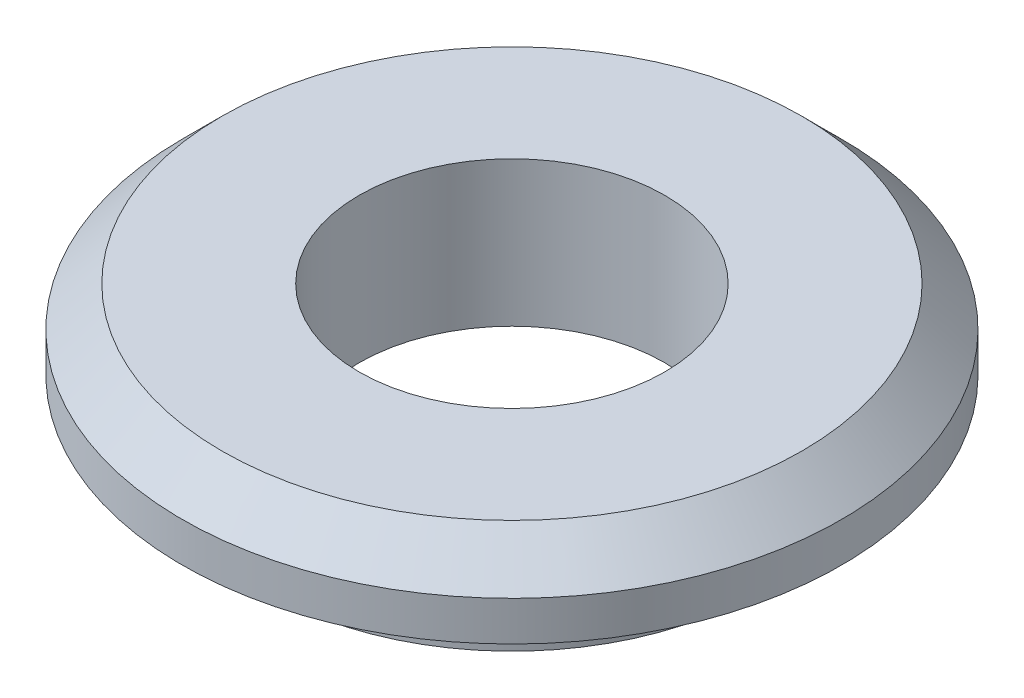
ISO-10303-21;
HEADER;
FILE_DESCRIPTION(('STEP AP214'),'2;1');
FILE_NAME('part.step','',(''),(''),'','','');
FILE_SCHEMA(('AUTOMOTIVE_DESIGN { 1 0 10303 214 1 1 1 1 }'));
ENDSEC;
DATA;
#1=APPLICATION_CONTEXT('core data for automotive mechanical design processes');
#2=APPLICATION_PROTOCOL_DEFINITION('international standard','automotive_design',2000,#1);
#3=PRODUCT_CONTEXT('',#1,'mechanical');
#4=PRODUCT('Part','Part','',(#3));
#5=PRODUCT_RELATED_PRODUCT_CATEGORY('part','',(#4));
#6=PRODUCT_DEFINITION_FORMATION('','',#4);
#7=PRODUCT_DEFINITION_CONTEXT('part definition',#1,'design');
#8=PRODUCT_DEFINITION('design','',#6,#7);
#9=PRODUCT_DEFINITION_SHAPE('','',#8);
#10=(LENGTH_UNIT() NAMED_UNIT(*) SI_UNIT(.MILLI.,.METRE.));
#11=(NAMED_UNIT(*) PLANE_ANGLE_UNIT() SI_UNIT($,.RADIAN.));
#12=(NAMED_UNIT(*) SI_UNIT($,.STERADIAN.) SOLID_ANGLE_UNIT());
#13=UNCERTAINTY_MEASURE_WITH_UNIT(LENGTH_MEASURE(1.E-05),#10,'distance_accuracy_value','');
#14=(GEOMETRIC_REPRESENTATION_CONTEXT(3) GLOBAL_UNCERTAINTY_ASSIGNED_CONTEXT((#13)) GLOBAL_UNIT_ASSIGNED_CONTEXT((#10,
#11,#12)) REPRESENTATION_CONTEXT('',''));
#15=CARTESIAN_POINT('',(0.,0.,0.));
#16=DIRECTION('',(0.,0.,1.));
#17=DIRECTION('',(1.,0.,0.));
#18=AXIS2_PLACEMENT_3D('',#15,#16,#17);
#19=CARTESIAN_POINT('',(-2.794,0.,0.));
#20=DIRECTION('',(0.,1.,0.));
#21=DIRECTION('',(-1.,0.,0.));
#22=AXIS2_PLACEMENT_3D('',#19,#20,#21);
#23=PLANE('',#22);
#24=CARTESIAN_POINT('',(0.,0.,0.));
#25=DIRECTION('',(0.,1.,0.));
#26=DIRECTION('',(-1.,0.,0.));
#27=AXIS2_PLACEMENT_3D('',#24,#25,#26);
#28=CIRCLE('',#27,2.794);
#29=CARTESIAN_POINT('',(-2.794,0.,0.));
#30=VERTEX_POINT('',#29);
#31=EDGE_CURVE('E65',#30,#30,#28,.T.);
#32=ORIENTED_EDGE('',*,*,#31,.T.);
#33=EDGE_LOOP('',(#32));
#34=FACE_BOUND('',#33,.T.);
#35=CARTESIAN_POINT('',(0.,0.,0.));
#36=DIRECTION('',(0.,1.,0.));
#37=DIRECTION('',(-1.,0.,0.));
#38=AXIS2_PLACEMENT_3D('',#35,#36,#37);
#39=CIRCLE('',#38,1.4732);
#40=CARTESIAN_POINT('',(-1.4732,0.,0.));
#41=VERTEX_POINT('',#40);
#42=EDGE_CURVE('E10',#41,#41,#39,.T.);
#43=ORIENTED_EDGE('',*,*,#42,.F.);
#44=EDGE_LOOP('',(#43));
#45=FACE_BOUND('',#44,.T.);
#46=ADVANCED_FACE('F34',(#34,#45),#23,.T.);
#47=CARTESIAN_POINT('',(0.,0.,0.));
#48=DIRECTION('',(0.,1.,0.));
#49=DIRECTION('',(-1.,0.,0.));
#50=AXIS2_PLACEMENT_3D('',#47,#48,#49);
#51=CYLINDRICAL_SURFACE('',#50,1.4732);
#52=ORIENTED_EDGE('',*,*,#42,.T.);
#53=EDGE_LOOP('',(#52));
#54=FACE_BOUND('',#53,.T.);
#55=CARTESIAN_POINT('',(0.,-1.397,0.));
#56=DIRECTION('',(0.,1.,0.));
#57=DIRECTION('',(-1.,0.,0.));
#58=AXIS2_PLACEMENT_3D('',#55,#56,#57);
#59=CIRCLE('',#58,1.4732);
#60=CARTESIAN_POINT('',(-1.4732,-1.397,0.));
#61=VERTEX_POINT('',#60);
#62=EDGE_CURVE('E41',#61,#61,#59,.T.);
#63=ORIENTED_EDGE('',*,*,#62,.F.);
#64=EDGE_LOOP('',(#63));
#65=FACE_BOUND('',#64,.T.);
#66=ADVANCED_FACE('F84',(#54,#65),#51,.F.);
#67=CARTESIAN_POINT('',(-1.4732,-1.397,0.));
#68=DIRECTION('',(0.,-1.,0.));
#69=DIRECTION('',(1.,0.,0.));
#70=AXIS2_PLACEMENT_3D('',#67,#68,#69);
#71=PLANE('',#70);
#72=ORIENTED_EDGE('',*,*,#62,.T.);
#73=EDGE_LOOP('',(#72));
#74=FACE_BOUND('',#73,.T.);
#75=CARTESIAN_POINT('',(0.,-1.397,0.));
#76=DIRECTION('',(0.,1.,0.));
#77=DIRECTION('',(-1.,0.,0.));
#78=AXIS2_PLACEMENT_3D('',#75,#76,#77);
#79=CIRCLE('',#78,2.3622);
#80=CARTESIAN_POINT('',(-2.3622,-1.397,0.));
#81=VERTEX_POINT('',#80);
#82=EDGE_CURVE('E48',#81,#81,#79,.T.);
#83=ORIENTED_EDGE('',*,*,#82,.F.);
#84=EDGE_LOOP('',(#83));
#85=FACE_BOUND('',#84,.T.);
#86=ADVANCED_FACE('F88',(#74,#85),#71,.T.);
#87=CARTESIAN_POINT('',(0.,0.,0.));
#88=DIRECTION('',(0.,1.,0.));
#89=DIRECTION('',(-1.,0.,0.));
#90=AXIS2_PLACEMENT_3D('',#87,#88,#89);
#91=CYLINDRICAL_SURFACE('',#90,2.3622);
#92=ORIENTED_EDGE('',*,*,#82,.T.);
#93=EDGE_LOOP('',(#92));
#94=FACE_BOUND('',#93,.T.);
#95=CARTESIAN_POINT('',(0.,-0.762,0.));
#96=DIRECTION('',(0.,1.,0.));
#97=DIRECTION('',(-1.,0.,0.));
#98=AXIS2_PLACEMENT_3D('',#95,#96,#97);
#99=CIRCLE('',#98,2.3622);
#100=CARTESIAN_POINT('',(-2.3622,-0.762,0.));
#101=VERTEX_POINT('',#100);
#102=EDGE_CURVE('E53',#101,#101,#99,.T.);
#103=ORIENTED_EDGE('',*,*,#102,.F.);
#104=EDGE_LOOP('',(#103));
#105=FACE_BOUND('',#104,.T.);
#106=ADVANCED_FACE('F92',(#94,#105),#91,.T.);
#107=CARTESIAN_POINT('',(-2.3622,-0.762,0.));
#108=DIRECTION('',(0.,-1.,0.));
#109=DIRECTION('',(1.,0.,0.));
#110=AXIS2_PLACEMENT_3D('',#107,#108,#109);
#111=PLANE('',#110);
#112=ORIENTED_EDGE('',*,*,#102,.T.);
#113=EDGE_LOOP('',(#112));
#114=FACE_BOUND('',#113,.T.);
#115=CARTESIAN_POINT('',(0.,-0.761999999999999,0.));
#116=DIRECTION('',(0.,1.,0.));
#117=DIRECTION('',(-1.,0.,0.));
#118=AXIS2_PLACEMENT_3D('',#115,#116,#117);
#119=CIRCLE('',#118,3.175);
#120=CARTESIAN_POINT('',(-3.175,-0.762,0.));
#121=VERTEX_POINT('',#120);
#122=EDGE_CURVE('E58',#121,#121,#119,.T.);
#123=ORIENTED_EDGE('',*,*,#122,.F.);
#124=EDGE_LOOP('',(#123));
#125=FACE_BOUND('',#124,.T.);
#126=ADVANCED_FACE('F80',(#114,#125),#111,.T.);
#127=CARTESIAN_POINT('',(0.,0.,0.));
#128=DIRECTION('',(0.,1.,0.));
#129=DIRECTION('',(-1.,0.,0.));
#130=AXIS2_PLACEMENT_3D('',#127,#128,#129);
#131=CYLINDRICAL_SURFACE('',#130,3.175);
#132=ORIENTED_EDGE('',*,*,#122,.T.);
#133=EDGE_LOOP('',(#132));
#134=FACE_BOUND('',#133,.T.);
#135=CARTESIAN_POINT('',(0.,-0.381,0.));
#136=DIRECTION('',(0.,1.,0.));
#137=DIRECTION('',(-1.,0.,0.));
#138=AXIS2_PLACEMENT_3D('',#135,#136,#137);
#139=CIRCLE('',#138,3.175);
#140=CARTESIAN_POINT('',(-3.175,-0.381,0.));
#141=VERTEX_POINT('',#140);
#142=EDGE_CURVE('E61',#141,#141,#139,.T.);
#143=ORIENTED_EDGE('',*,*,#142,.F.);
#144=EDGE_LOOP('',(#143));
#145=FACE_BOUND('',#144,.T.);
#146=ADVANCED_FACE('F74',(#134,#145),#131,.T.);
#147=CARTESIAN_POINT('',(0.,0.,0.));
#148=DIRECTION('',(0.,-1.,0.));
#149=DIRECTION('',(1.,0.,0.));
#150=AXIS2_PLACEMENT_3D('',#147,#148,#149);
#151=CONICAL_SURFACE('',#150,2.794,0.78539816339745);
#152=ORIENTED_EDGE('',*,*,#142,.T.);
#153=EDGE_LOOP('',(#152));
#154=FACE_BOUND('',#153,.T.);
#155=ORIENTED_EDGE('',*,*,#31,.F.);
#156=EDGE_LOOP('',(#155));
#157=FACE_BOUND('',#156,.T.);
#158=ADVANCED_FACE('F72',(#154,#157),#151,.T.);
#159=CLOSED_SHELL('',(#46,#66,#86,#106,#126,#146,#158));
#160=MANIFOLD_SOLID_BREP('B2',#159);
#161=ADVANCED_BREP_SHAPE_REPRESENTATION('',(#18,#160),#14);
#162=SHAPE_DEFINITION_REPRESENTATION(#9,#161);
ENDSEC;
END-ISO-10303-21;
